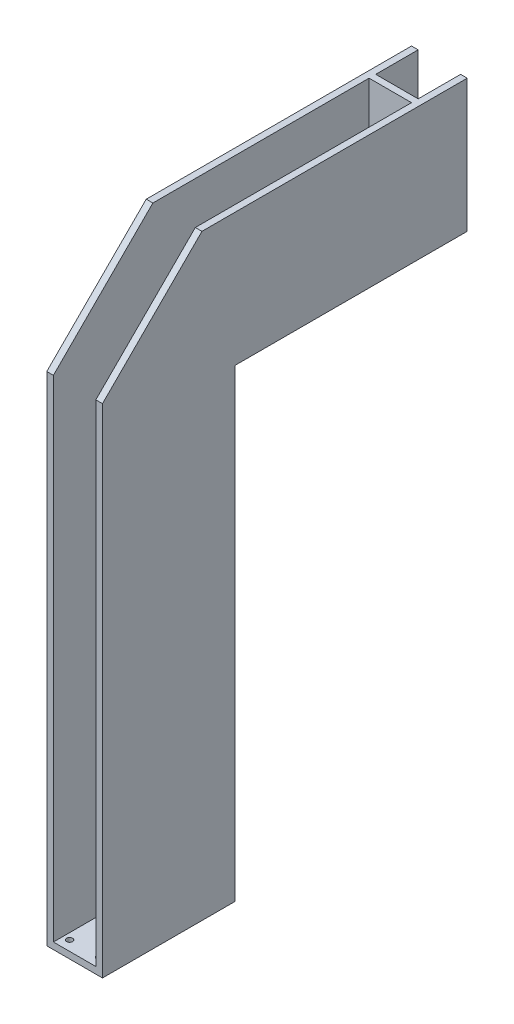
ISO-10303-21;
HEADER;
FILE_DESCRIPTION(('STEP AP214'),'2;1');
FILE_NAME('part.step','',(''),(''),'','','');
FILE_SCHEMA(('AUTOMOTIVE_DESIGN { 1 0 10303 214 1 1 1 1 }'));
ENDSEC;
DATA;
#1=APPLICATION_CONTEXT('core data for automotive mechanical design processes');
#2=APPLICATION_PROTOCOL_DEFINITION('international standard','automotive_design',2000,#1);
#3=PRODUCT_CONTEXT('',#1,'mechanical');
#4=PRODUCT('Part','Part','',(#3));
#5=PRODUCT_RELATED_PRODUCT_CATEGORY('part','',(#4));
#6=PRODUCT_DEFINITION_FORMATION('','',#4);
#7=PRODUCT_DEFINITION_CONTEXT('part definition',#1,'design');
#8=PRODUCT_DEFINITION('design','',#6,#7);
#9=PRODUCT_DEFINITION_SHAPE('','',#8);
#10=(LENGTH_UNIT() NAMED_UNIT(*) SI_UNIT(.MILLI.,.METRE.));
#11=(NAMED_UNIT(*) PLANE_ANGLE_UNIT() SI_UNIT($,.RADIAN.));
#12=(NAMED_UNIT(*) SI_UNIT($,.STERADIAN.) SOLID_ANGLE_UNIT());
#13=UNCERTAINTY_MEASURE_WITH_UNIT(LENGTH_MEASURE(1.E-05),#10,'distance_accuracy_value','');
#14=(GEOMETRIC_REPRESENTATION_CONTEXT(3) GLOBAL_UNCERTAINTY_ASSIGNED_CONTEXT((#13)) GLOBAL_UNIT_ASSIGNED_CONTEXT((#10,
#11,#12)) REPRESENTATION_CONTEXT('',''));
#15=CARTESIAN_POINT('',(0.,0.,0.));
#16=DIRECTION('',(0.,0.,1.));
#17=DIRECTION('',(1.,0.,0.));
#18=AXIS2_PLACEMENT_3D('',#15,#16,#17);
#19=CARTESIAN_POINT('',(0.,-553.711116016285,-550.));
#20=DIRECTION('',(1.,0.,0.));
#21=DIRECTION('',(0.,0.,-1.));
#22=AXIS2_PLACEMENT_3D('',#19,#20,#21);
#23=PLANE('',#22);
#24=DIRECTION('',(0.,-1.,0.));
#25=VECTOR('',#24,1.);
#26=CARTESIAN_POINT('',(0.,710.,-486.));
#27=LINE('',#26,#25);
#28=CARTESIAN_POINT('',(0.,900.,-486.));
#29=VERTEX_POINT('',#28);
#30=CARTESIAN_POINT('',(0.,710.,-486.));
#31=VERTEX_POINT('',#30);
#32=EDGE_CURVE('E52',#29,#31,#27,.T.);
#33=ORIENTED_EDGE('',*,*,#32,.F.);
#34=DIRECTION('',(0.,0.,-1.));
#35=VECTOR('',#34,1.);
#36=CARTESIAN_POINT('',(0.,900.,-550.));
#37=LINE('',#36,#35);
#38=CARTESIAN_POINT('',(0.,900.,-550.));
#39=VERTEX_POINT('',#38);
#40=EDGE_CURVE('E211',#29,#39,#37,.T.);
#41=ORIENTED_EDGE('',*,*,#40,.T.);
#42=DIRECTION('',(0.,1.,0.));
#43=VECTOR('',#42,1.);
#44=CARTESIAN_POINT('',(0.,-553.711116016285,-550.));
#45=LINE('',#44,#43);
#46=CARTESIAN_POINT('',(0.,710.,-550.));
#47=VERTEX_POINT('',#46);
#48=EDGE_CURVE('E225',#47,#39,#45,.T.);
#49=ORIENTED_EDGE('',*,*,#48,.F.);
#50=DIRECTION('',(0.,0.,1.));
#51=VECTOR('',#50,1.);
#52=CARTESIAN_POINT('',(0.,710.,-550.));
#53=LINE('',#52,#51);
#54=EDGE_CURVE('E188',#47,#31,#53,.T.);
#55=ORIENTED_EDGE('',*,*,#54,.T.);
#56=EDGE_LOOP('',(#33,#41,#49,#55));
#57=FACE_BOUND('',#56,.T.);
#58=ADVANCED_FACE('F37',(#57),#23,.F.);
#59=CARTESIAN_POINT('',(-64.,-553.711116016285,-550.));
#60=DIRECTION('',(-1.,0.,0.));
#61=DIRECTION('',(0.,0.,1.));
#62=AXIS2_PLACEMENT_3D('',#59,#60,#61);
#63=PLANE('',#62);
#64=DIRECTION('',(0.,1.,0.));
#65=VECTOR('',#64,1.);
#66=CARTESIAN_POINT('',(-64.,710.,-486.));
#67=LINE('',#66,#65);
#68=CARTESIAN_POINT('',(-64.,710.,-486.));
#69=VERTEX_POINT('',#68);
#70=CARTESIAN_POINT('',(-64.,900.,-486.));
#71=VERTEX_POINT('',#70);
#72=EDGE_CURVE('E344',#69,#71,#67,.T.);
#73=ORIENTED_EDGE('',*,*,#72,.F.);
#74=DIRECTION('',(0.,0.,-1.));
#75=VECTOR('',#74,1.);
#76=CARTESIAN_POINT('',(-64.,710.,-550.));
#77=LINE('',#76,#75);
#78=CARTESIAN_POINT('',(-64.,710.,-550.));
#79=VERTEX_POINT('',#78);
#80=EDGE_CURVE('E202',#69,#79,#77,.T.);
#81=ORIENTED_EDGE('',*,*,#80,.T.);
#82=DIRECTION('',(0.,1.,0.));
#83=VECTOR('',#82,1.);
#84=CARTESIAN_POINT('',(-64.,-553.711116016285,-550.));
#85=LINE('',#84,#83);
#86=CARTESIAN_POINT('',(-64.,900.,-550.));
#87=VERTEX_POINT('',#86);
#88=EDGE_CURVE('E221',#79,#87,#85,.T.);
#89=ORIENTED_EDGE('',*,*,#88,.T.);
#90=DIRECTION('',(0.,0.,1.));
#91=VECTOR('',#90,1.);
#92=CARTESIAN_POINT('',(-64.,900.,-550.));
#93=LINE('',#92,#91);
#94=EDGE_CURVE('E212',#87,#71,#93,.T.);
#95=ORIENTED_EDGE('',*,*,#94,.T.);
#96=EDGE_LOOP('',(#73,#81,#89,#95));
#97=FACE_BOUND('',#96,.T.);
#98=ADVANCED_FACE('F356',(#97),#63,.F.);
#99=CARTESIAN_POINT('',(0.,710.,0.));
#100=DIRECTION('',(0.,1.,0.));
#101=DIRECTION('',(0.,0.,1.));
#102=AXIS2_PLACEMENT_3D('',#99,#100,#101);
#103=PLANE('',#102);
#104=CARTESIAN_POINT('',(-8.49999999999964,710.,-540.999999999998));
#105=DIRECTION('',(0.,1.,0.));
#106=DIRECTION('',(0.,0.,1.));
#107=AXIS2_PLACEMENT_3D('',#104,#105,#106);
#108=CIRCLE('',#107,4.5);
#109=CARTESIAN_POINT('',(-8.49999999999964,710.,-536.499999999998));
#110=VERTEX_POINT('',#109);
#111=EDGE_CURVE('E668',#110,#110,#108,.T.);
#112=ORIENTED_EDGE('',*,*,#111,.F.);
#113=EDGE_LOOP('',(#112));
#114=FACE_BOUND('',#113,.T.);
#115=CARTESIAN_POINT('',(-54.9999999999996,710.,-540.999999999998));
#116=DIRECTION('',(0.,1.,0.));
#117=DIRECTION('',(0.,0.,1.));
#118=AXIS2_PLACEMENT_3D('',#115,#116,#117);
#119=CIRCLE('',#118,4.5);
#120=CARTESIAN_POINT('',(-54.9999999999996,710.,-536.499999999998));
#121=VERTEX_POINT('',#120);
#122=EDGE_CURVE('E662',#121,#121,#119,.T.);
#123=ORIENTED_EDGE('',*,*,#122,.F.);
#124=EDGE_LOOP('',(#123));
#125=FACE_BOUND('',#124,.T.);
#126=CARTESIAN_POINT('',(-54.9999999999996,710.,-494.499999999998));
#127=DIRECTION('',(0.,1.,0.));
#128=DIRECTION('',(0.,0.,1.));
#129=AXIS2_PLACEMENT_3D('',#126,#127,#128);
#130=CIRCLE('',#129,4.5);
#131=CARTESIAN_POINT('',(-54.9999999999996,710.,-489.999999999998));
#132=VERTEX_POINT('',#131);
#133=EDGE_CURVE('E656',#132,#132,#130,.T.);
#134=ORIENTED_EDGE('',*,*,#133,.F.);
#135=EDGE_LOOP('',(#134));
#136=FACE_BOUND('',#135,.T.);
#137=CARTESIAN_POINT('',(-8.49999999999964,710.,-494.499999999998));
#138=DIRECTION('',(0.,1.,0.));
#139=DIRECTION('',(0.,0.,1.));
#140=AXIS2_PLACEMENT_3D('',#137,#138,#139);
#141=CIRCLE('',#140,4.5);
#142=CARTESIAN_POINT('',(-8.49999999999964,710.,-489.999999999998));
#143=VERTEX_POINT('',#142);
#144=EDGE_CURVE('E342',#143,#143,#141,.T.);
#145=ORIENTED_EDGE('',*,*,#144,.F.);
#146=EDGE_LOOP('',(#145));
#147=FACE_BOUND('',#146,.T.);
#148=ORIENTED_EDGE('',*,*,#80,.F.);
#149=DIRECTION('',(-1.,0.,0.));
#150=VECTOR('',#149,1.);
#151=CARTESIAN_POINT('',(0.,710.,-486.));
#152=LINE('',#151,#150);
#153=EDGE_CURVE('E341',#31,#69,#152,.T.);
#154=ORIENTED_EDGE('',*,*,#153,.F.);
#155=ORIENTED_EDGE('',*,*,#54,.F.);
#156=DIRECTION('',(1.,0.,0.));
#157=VECTOR('',#156,1.);
#158=CARTESIAN_POINT('',(-64.,710.,-550.));
#159=LINE('',#158,#157);
#160=EDGE_CURVE('E189',#79,#47,#159,.T.);
#161=ORIENTED_EDGE('',*,*,#160,.F.);
#162=EDGE_LOOP('',(#148,#154,#155,#161));
#163=FACE_BOUND('',#162,.T.);
#164=ADVANCED_FACE('F359',(#114,#125,#136,#147,#163),#103,.T.);
#165=CARTESIAN_POINT('',(-74.,750.,0.));
#166=DIRECTION('',(0.,0.707106781186546,0.707106781186549));
#167=DIRECTION('',(0.,-0.707106781186549,0.707106781186546));
#168=AXIS2_PLACEMENT_3D('',#165,#166,#167);
#169=PLANE('',#168);
#170=DIRECTION('',(0.,0.707106781186549,-0.707106781186546));
#171=VECTOR('',#170,1.);
#172=CARTESIAN_POINT('',(0.,750.,0.));
#173=LINE('',#172,#171);
#174=CARTESIAN_POINT('',(0.,750.,0.));
#175=VERTEX_POINT('',#174);
#176=CARTESIAN_POINT('',(0.,900.,-149.999999999999));
#177=VERTEX_POINT('',#176);
#178=EDGE_CURVE('E234',#175,#177,#173,.T.);
#179=ORIENTED_EDGE('',*,*,#178,.F.);
#180=DIRECTION('',(1.,0.,0.));
#181=VECTOR('',#180,1.);
#182=CARTESIAN_POINT('',(-74.,750.,0.));
#183=LINE('',#182,#181);
#184=CARTESIAN_POINT('',(10.,750.,0.));
#185=VERTEX_POINT('',#184);
#186=EDGE_CURVE('E285',#175,#185,#183,.T.);
#187=ORIENTED_EDGE('',*,*,#186,.T.);
#188=DIRECTION('',(0.,-0.707106781186549,0.707106781186546));
#189=VECTOR('',#188,1.);
#190=CARTESIAN_POINT('',(10.,750.,0.));
#191=LINE('',#190,#189);
#192=CARTESIAN_POINT('',(10.,900.,-149.999999999999));
#193=VERTEX_POINT('',#192);
#194=EDGE_CURVE('E251',#193,#185,#191,.T.);
#195=ORIENTED_EDGE('',*,*,#194,.F.);
#196=DIRECTION('',(1.,0.,0.));
#197=VECTOR('',#196,1.);
#198=CARTESIAN_POINT('',(-74.,900.,-149.999999999999));
#199=LINE('',#198,#197);
#200=EDGE_CURVE('E289',#177,#193,#199,.T.);
#201=ORIENTED_EDGE('',*,*,#200,.F.);
#202=EDGE_LOOP('',(#179,#187,#195,#201));
#203=FACE_BOUND('',#202,.T.);
#204=ADVANCED_FACE('F322',(#203),#169,.T.);
#205=CARTESIAN_POINT('',(-74.,0.,-200.));
#206=DIRECTION('',(0.,-1.,0.));
#207=DIRECTION('',(0.,0.,-1.));
#208=AXIS2_PLACEMENT_3D('',#205,#206,#207);
#209=PLANE('',#208);
#210=CARTESIAN_POINT('',(-9.49999999999995,0.,-185.));
#211=DIRECTION('',(0.,-1.,0.));
#212=DIRECTION('',(0.,0.,-1.));
#213=AXIS2_PLACEMENT_3D('',#210,#211,#212);
#214=CIRCLE('',#213,4.5);
#215=CARTESIAN_POINT('',(-9.49999999999995,0.,-189.5));
#216=VERTEX_POINT('',#215);
#217=EDGE_CURVE('E631',#216,#216,#214,.F.);
#218=ORIENTED_EDGE('',*,*,#217,.T.);
#219=EDGE_LOOP('',(#218));
#220=FACE_BOUND('',#219,.T.);
#221=CARTESIAN_POINT('',(-9.49999999999997,0.,-35.));
#222=DIRECTION('',(0.,-1.,0.));
#223=DIRECTION('',(0.,0.,-1.));
#224=AXIS2_PLACEMENT_3D('',#221,#222,#223);
#225=CIRCLE('',#224,5.);
#226=CARTESIAN_POINT('',(-9.49999999999997,0.,-40.));
#227=VERTEX_POINT('',#226);
#228=EDGE_CURVE('E634',#227,#227,#225,.F.);
#229=ORIENTED_EDGE('',*,*,#228,.T.);
#230=EDGE_LOOP('',(#229));
#231=FACE_BOUND('',#230,.T.);
#232=CARTESIAN_POINT('',(-9.49999999999995,0.,-15.));
#233=DIRECTION('',(0.,-1.,0.));
#234=DIRECTION('',(0.,0.,-1.));
#235=AXIS2_PLACEMENT_3D('',#232,#233,#234);
#236=CIRCLE('',#235,4.5);
#237=CARTESIAN_POINT('',(-9.49999999999995,0.,-19.5));
#238=VERTEX_POINT('',#237);
#239=EDGE_CURVE('E736',#238,#238,#236,.F.);
#240=ORIENTED_EDGE('',*,*,#239,.T.);
#241=EDGE_LOOP('',(#240));
#242=FACE_BOUND('',#241,.T.);
#243=CARTESIAN_POINT('',(-54.5,0.,-15.));
#244=DIRECTION('',(0.,-1.,0.));
#245=DIRECTION('',(0.,0.,-1.));
#246=AXIS2_PLACEMENT_3D('',#243,#244,#245);
#247=CIRCLE('',#246,4.5);
#248=CARTESIAN_POINT('',(-54.5,0.,-19.5));
#249=VERTEX_POINT('',#248);
#250=EDGE_CURVE('E730',#249,#249,#247,.F.);
#251=ORIENTED_EDGE('',*,*,#250,.T.);
#252=EDGE_LOOP('',(#251));
#253=FACE_BOUND('',#252,.T.);
#254=CARTESIAN_POINT('',(-54.4999999999999,0.,-165.));
#255=DIRECTION('',(0.,-1.,0.));
#256=DIRECTION('',(0.,0.,-1.));
#257=AXIS2_PLACEMENT_3D('',#254,#255,#256);
#258=CIRCLE('',#257,5.);
#259=CARTESIAN_POINT('',(-54.4999999999999,0.,-170.));
#260=VERTEX_POINT('',#259);
#261=EDGE_CURVE('E720',#260,#260,#258,.F.);
#262=ORIENTED_EDGE('',*,*,#261,.T.);
#263=EDGE_LOOP('',(#262));
#264=FACE_BOUND('',#263,.T.);
#265=CARTESIAN_POINT('',(-54.4999999999999,0.,-185.));
#266=DIRECTION('',(0.,-1.,0.));
#267=DIRECTION('',(0.,0.,-1.));
#268=AXIS2_PLACEMENT_3D('',#265,#266,#267);
#269=CIRCLE('',#268,4.5);
#270=CARTESIAN_POINT('',(-54.4999999999999,0.,-189.5));
#271=VERTEX_POINT('',#270);
#272=EDGE_CURVE('E646',#271,#271,#269,.F.);
#273=ORIENTED_EDGE('',*,*,#272,.T.);
#274=EDGE_LOOP('',(#273));
#275=FACE_BOUND('',#274,.T.);
#276=DIRECTION('',(1.,0.,0.));
#277=VECTOR('',#276,1.);
#278=CARTESIAN_POINT('',(-74.,0.,-200.));
#279=LINE('',#278,#277);
#280=CARTESIAN_POINT('',(-74.,0.,-200.));
#281=VERTEX_POINT('',#280);
#282=CARTESIAN_POINT('',(10.,0.,-200.));
#283=VERTEX_POINT('',#282);
#284=EDGE_CURVE('E278',#281,#283,#279,.T.);
#285=ORIENTED_EDGE('',*,*,#284,.T.);
#286=DIRECTION('',(0.,0.,-1.));
#287=VECTOR('',#286,1.);
#288=CARTESIAN_POINT('',(10.,0.,-200.));
#289=LINE('',#288,#287);
#290=CARTESIAN_POINT('',(10.,0.,0.));
#291=VERTEX_POINT('',#290);
#292=EDGE_CURVE('E236',#291,#283,#289,.T.);
#293=ORIENTED_EDGE('',*,*,#292,.F.);
#294=DIRECTION('',(1.,0.,0.));
#295=VECTOR('',#294,1.);
#296=CARTESIAN_POINT('',(-74.,0.,0.));
#297=LINE('',#296,#295);
#298=CARTESIAN_POINT('',(-74.,0.,0.));
#299=VERTEX_POINT('',#298);
#300=EDGE_CURVE('E279',#299,#291,#297,.T.);
#301=ORIENTED_EDGE('',*,*,#300,.F.);
#302=DIRECTION('',(0.,0.,-1.));
#303=VECTOR('',#302,1.);
#304=CARTESIAN_POINT('',(-74.,0.,-200.));
#305=LINE('',#304,#303);
#306=EDGE_CURVE('E257',#299,#281,#305,.T.);
#307=ORIENTED_EDGE('',*,*,#306,.T.);
#308=EDGE_LOOP('',(#285,#293,#301,#307));
#309=FACE_BOUND('',#308,.T.);
#310=ADVANCED_FACE('F39',(#220,#231,#242,#253,#264,#275,#309),#209,.T.);
#311=CARTESIAN_POINT('',(-74.,0.,0.));
#312=DIRECTION('',(0.,0.,1.));
#313=DIRECTION('',(1.,0.,0.));
#314=AXIS2_PLACEMENT_3D('',#311,#312,#313);
#315=PLANE('',#314);
#316=DIRECTION('',(0.,1.,0.));
#317=VECTOR('',#316,1.);
#318=CARTESIAN_POINT('',(0.,-553.711116016285,0.));
#319=LINE('',#318,#317);
#320=CARTESIAN_POINT('',(0.,10.,0.));
#321=VERTEX_POINT('',#320);
#322=EDGE_CURVE('E217',#321,#175,#319,.T.);
#323=ORIENTED_EDGE('',*,*,#322,.F.);
#324=DIRECTION('',(1.,0.,0.));
#325=VECTOR('',#324,1.);
#326=CARTESIAN_POINT('',(-64.,10.,0.));
#327=LINE('',#326,#325);
#328=CARTESIAN_POINT('',(-64.,10.,0.));
#329=VERTEX_POINT('',#328);
#330=EDGE_CURVE('E210',#329,#321,#327,.T.);
#331=ORIENTED_EDGE('',*,*,#330,.F.);
#332=DIRECTION('',(0.,1.,0.));
#333=VECTOR('',#332,1.);
#334=CARTESIAN_POINT('',(-64.,-553.711116016285,0.));
#335=LINE('',#334,#333);
#336=CARTESIAN_POINT('',(-64.,750.,0.));
#337=VERTEX_POINT('',#336);
#338=EDGE_CURVE('E220',#329,#337,#335,.T.);
#339=ORIENTED_EDGE('',*,*,#338,.T.);
#340=CARTESIAN_POINT('',(-74.,750.,0.));
#341=VERTEX_POINT('',#340);
#342=EDGE_CURVE('E282',#341,#337,#183,.T.);
#343=ORIENTED_EDGE('',*,*,#342,.F.);
#344=DIRECTION('',(0.,-1.,0.));
#345=VECTOR('',#344,1.);
#346=CARTESIAN_POINT('',(-74.,0.,0.));
#347=LINE('',#346,#345);
#348=EDGE_CURVE('E275',#341,#299,#347,.T.);
#349=ORIENTED_EDGE('',*,*,#348,.T.);
#350=ORIENTED_EDGE('',*,*,#300,.T.);
#351=DIRECTION('',(0.,-1.,0.));
#352=VECTOR('',#351,1.);
#353=CARTESIAN_POINT('',(10.,0.,0.));
#354=LINE('',#353,#352);
#355=EDGE_CURVE('E254',#185,#291,#354,.T.);
#356=ORIENTED_EDGE('',*,*,#355,.F.);
#357=ORIENTED_EDGE('',*,*,#186,.F.);
#358=EDGE_LOOP('',(#323,#331,#339,#343,#349,#350,#356,#357));
#359=FACE_BOUND('',#358,.T.);
#360=ADVANCED_FACE('F316',(#359),#315,.T.);
#361=DIRECTION('',(0.,-0.707106781186549,0.707106781186546));
#362=VECTOR('',#361,1.);
#363=CARTESIAN_POINT('',(-64.,750.,0.));
#364=LINE('',#363,#362);
#365=CARTESIAN_POINT('',(-64.,900.,-149.999999999999));
#366=VERTEX_POINT('',#365);
#367=EDGE_CURVE('E232',#366,#337,#364,.T.);
#368=ORIENTED_EDGE('',*,*,#367,.F.);
#369=CARTESIAN_POINT('',(-74.,900.,-149.999999999999));
#370=VERTEX_POINT('',#369);
#371=EDGE_CURVE('E286',#370,#366,#199,.T.);
#372=ORIENTED_EDGE('',*,*,#371,.F.);
#373=DIRECTION('',(0.,-0.707106781186549,0.707106781186546));
#374=VECTOR('',#373,1.);
#375=CARTESIAN_POINT('',(-74.,750.,0.));
#376=LINE('',#375,#374);
#377=EDGE_CURVE('E272',#370,#341,#376,.T.);
#378=ORIENTED_EDGE('',*,*,#377,.T.);
#379=ORIENTED_EDGE('',*,*,#342,.T.);
#380=EDGE_LOOP('',(#368,#372,#378,#379));
#381=FACE_BOUND('',#380,.T.);
#382=ADVANCED_FACE('F403',(#381),#169,.T.);
#383=CARTESIAN_POINT('',(-74.,900.,-149.999999999999));
#384=DIRECTION('',(0.,1.,0.));
#385=DIRECTION('',(0.,0.,1.));
#386=AXIS2_PLACEMENT_3D('',#383,#384,#385);
#387=PLANE('',#386);
#388=ORIENTED_EDGE('',*,*,#94,.F.);
#389=DIRECTION('',(1.,0.,0.));
#390=VECTOR('',#389,1.);
#391=CARTESIAN_POINT('',(-74.,900.,-550.));
#392=LINE('',#391,#390);
#393=CARTESIAN_POINT('',(-74.,900.,-550.));
#394=VERTEX_POINT('',#393);
#395=EDGE_CURVE('E290',#394,#87,#392,.T.);
#396=ORIENTED_EDGE('',*,*,#395,.F.);
#397=DIRECTION('',(0.,0.,1.));
#398=VECTOR('',#397,1.);
#399=CARTESIAN_POINT('',(-74.,900.,-149.999999999999));
#400=LINE('',#399,#398);
#401=EDGE_CURVE('E269',#394,#370,#400,.T.);
#402=ORIENTED_EDGE('',*,*,#401,.T.);
#403=ORIENTED_EDGE('',*,*,#371,.T.);
#404=CARTESIAN_POINT('',(-64.,900.,-476.));
#405=VERTEX_POINT('',#404);
#406=EDGE_CURVE('E207',#405,#366,#93,.T.);
#407=ORIENTED_EDGE('',*,*,#406,.F.);
#408=DIRECTION('',(1.,0.,0.));
#409=VECTOR('',#408,1.);
#410=CARTESIAN_POINT('',(0.,900.,-476.));
#411=LINE('',#410,#409);
#412=CARTESIAN_POINT('',(0.,900.,-476.));
#413=VERTEX_POINT('',#412);
#414=EDGE_CURVE('E203',#405,#413,#411,.T.);
#415=ORIENTED_EDGE('',*,*,#414,.T.);
#416=EDGE_CURVE('E181',#177,#413,#37,.T.);
#417=ORIENTED_EDGE('',*,*,#416,.F.);
#418=ORIENTED_EDGE('',*,*,#200,.T.);
#419=DIRECTION('',(0.,0.,1.));
#420=VECTOR('',#419,1.);
#421=CARTESIAN_POINT('',(10.,900.,-149.999999999999));
#422=LINE('',#421,#420);
#423=CARTESIAN_POINT('',(10.,900.,-550.));
#424=VERTEX_POINT('',#423);
#425=EDGE_CURVE('E248',#424,#193,#422,.T.);
#426=ORIENTED_EDGE('',*,*,#425,.F.);
#427=EDGE_CURVE('E293',#39,#424,#392,.T.);
#428=ORIENTED_EDGE('',*,*,#427,.F.);
#429=ORIENTED_EDGE('',*,*,#40,.F.);
#430=DIRECTION('',(1.,0.,0.));
#431=VECTOR('',#430,1.);
#432=CARTESIAN_POINT('',(0.,900.,-486.));
#433=LINE('',#432,#431);
#434=EDGE_CURVE('E182',#71,#29,#433,.T.);
#435=ORIENTED_EDGE('',*,*,#434,.F.);
#436=EDGE_LOOP('',(#388,#396,#402,#403,#407,#415,#417,#418,#426,#428,#429,#435));
#437=FACE_BOUND('',#436,.T.);
#438=ADVANCED_FACE('F327',(#437),#387,.T.);
#439=CARTESIAN_POINT('',(-74.,900.,-550.));
#440=DIRECTION('',(0.,0.,-1.));
#441=DIRECTION('',(-1.,0.,0.));
#442=AXIS2_PLACEMENT_3D('',#439,#440,#441);
#443=PLANE('',#442);
#444=ORIENTED_EDGE('',*,*,#88,.F.);
#445=ORIENTED_EDGE('',*,*,#160,.T.);
#446=ORIENTED_EDGE('',*,*,#48,.T.);
#447=ORIENTED_EDGE('',*,*,#427,.T.);
#448=DIRECTION('',(0.,1.,0.));
#449=VECTOR('',#448,1.);
#450=CARTESIAN_POINT('',(10.,900.,-550.));
#451=LINE('',#450,#449);
#452=CARTESIAN_POINT('',(10.,700.,-550.));
#453=VERTEX_POINT('',#452);
#454=EDGE_CURVE('E245',#453,#424,#451,.T.);
#455=ORIENTED_EDGE('',*,*,#454,.F.);
#456=DIRECTION('',(1.,0.,0.));
#457=VECTOR('',#456,1.);
#458=CARTESIAN_POINT('',(-74.,700.,-550.));
#459=LINE('',#458,#457);
#460=CARTESIAN_POINT('',(-74.,700.,-550.));
#461=VERTEX_POINT('',#460);
#462=EDGE_CURVE('E294',#461,#453,#459,.T.);
#463=ORIENTED_EDGE('',*,*,#462,.F.);
#464=DIRECTION('',(0.,1.,0.));
#465=VECTOR('',#464,1.);
#466=CARTESIAN_POINT('',(-74.,900.,-550.));
#467=LINE('',#466,#465);
#468=EDGE_CURVE('E266',#461,#394,#467,.T.);
#469=ORIENTED_EDGE('',*,*,#468,.T.);
#470=ORIENTED_EDGE('',*,*,#395,.T.);
#471=EDGE_LOOP('',(#444,#445,#446,#447,#455,#463,#469,#470));
#472=FACE_BOUND('',#471,.T.);
#473=ADVANCED_FACE('F335',(#472),#443,.T.);
#474=CARTESIAN_POINT('',(-74.,700.,-550.));
#475=DIRECTION('',(0.,-1.,0.));
#476=DIRECTION('',(0.,0.,-1.));
#477=AXIS2_PLACEMENT_3D('',#474,#475,#476);
#478=PLANE('',#477);
#479=CARTESIAN_POINT('',(-8.49999999999964,700.,-540.999999999998));
#480=DIRECTION('',(0.,-1.,0.));
#481=DIRECTION('',(0.,0.,-1.));
#482=AXIS2_PLACEMENT_3D('',#479,#480,#481);
#483=CIRCLE('',#482,4.5);
#484=CARTESIAN_POINT('',(-8.49999999999964,700.,-545.499999999998));
#485=VERTEX_POINT('',#484);
#486=EDGE_CURVE('E655',#485,#485,#483,.F.);
#487=ORIENTED_EDGE('',*,*,#486,.T.);
#488=EDGE_LOOP('',(#487));
#489=FACE_BOUND('',#488,.T.);
#490=CARTESIAN_POINT('',(-54.9999999999996,700.,-540.999999999998));
#491=DIRECTION('',(0.,-1.,0.));
#492=DIRECTION('',(0.,0.,-1.));
#493=AXIS2_PLACEMENT_3D('',#490,#491,#492);
#494=CIRCLE('',#493,4.5);
#495=CARTESIAN_POINT('',(-54.9999999999996,700.,-545.499999999998));
#496=VERTEX_POINT('',#495);
#497=EDGE_CURVE('E665',#496,#496,#494,.F.);
#498=ORIENTED_EDGE('',*,*,#497,.T.);
#499=EDGE_LOOP('',(#498));
#500=FACE_BOUND('',#499,.T.);
#501=CARTESIAN_POINT('',(-54.9999999999996,700.,-494.499999999998));
#502=DIRECTION('',(0.,-1.,0.));
#503=DIRECTION('',(0.,0.,-1.));
#504=AXIS2_PLACEMENT_3D('',#501,#502,#503);
#505=CIRCLE('',#504,4.5);
#506=CARTESIAN_POINT('',(-54.9999999999996,700.,-498.999999999998));
#507=VERTEX_POINT('',#506);
#508=EDGE_CURVE('E659',#507,#507,#505,.F.);
#509=ORIENTED_EDGE('',*,*,#508,.T.);
#510=EDGE_LOOP('',(#509));
#511=FACE_BOUND('',#510,.T.);
#512=CARTESIAN_POINT('',(-8.49999999999964,700.,-494.499999999998));
#513=DIRECTION('',(0.,-1.,0.));
#514=DIRECTION('',(0.,0.,-1.));
#515=AXIS2_PLACEMENT_3D('',#512,#513,#514);
#516=CIRCLE('',#515,4.5);
#517=CARTESIAN_POINT('',(-8.49999999999964,700.,-498.999999999998));
#518=VERTEX_POINT('',#517);
#519=EDGE_CURVE('E347',#518,#518,#516,.F.);
#520=ORIENTED_EDGE('',*,*,#519,.T.);
#521=EDGE_LOOP('',(#520));
#522=FACE_BOUND('',#521,.T.);
#523=ORIENTED_EDGE('',*,*,#462,.T.);
#524=DIRECTION('',(0.,0.,-1.));
#525=VECTOR('',#524,1.);
#526=CARTESIAN_POINT('',(10.,700.,-550.));
#527=LINE('',#526,#525);
#528=CARTESIAN_POINT('',(10.,700.,-200.));
#529=VERTEX_POINT('',#528);
#530=EDGE_CURVE('E242',#529,#453,#527,.T.);
#531=ORIENTED_EDGE('',*,*,#530,.F.);
#532=DIRECTION('',(1.,0.,0.));
#533=VECTOR('',#532,1.);
#534=CARTESIAN_POINT('',(-74.,700.,-200.));
#535=LINE('',#534,#533);
#536=CARTESIAN_POINT('',(0.,700.,-200.));
#537=VERTEX_POINT('',#536);
#538=EDGE_CURVE('E299',#537,#529,#535,.T.);
#539=ORIENTED_EDGE('',*,*,#538,.F.);
#540=DIRECTION('',(-1.,0.,0.));
#541=VECTOR('',#540,1.);
#542=CARTESIAN_POINT('',(-64.,700.,-200.));
#543=LINE('',#542,#541);
#544=CARTESIAN_POINT('',(-64.,700.,-200.));
#545=VERTEX_POINT('',#544);
#546=EDGE_CURVE('E199',#537,#545,#543,.T.);
#547=ORIENTED_EDGE('',*,*,#546,.T.);
#548=CARTESIAN_POINT('',(-74.,700.,-200.));
#549=VERTEX_POINT('',#548);
#550=EDGE_CURVE('E296',#549,#545,#535,.T.);
#551=ORIENTED_EDGE('',*,*,#550,.F.);
#552=DIRECTION('',(0.,0.,-1.));
#553=VECTOR('',#552,1.);
#554=CARTESIAN_POINT('',(-74.,700.,-550.));
#555=LINE('',#554,#553);
#556=EDGE_CURVE('E263',#549,#461,#555,.T.);
#557=ORIENTED_EDGE('',*,*,#556,.T.);
#558=EDGE_LOOP('',(#523,#531,#539,#547,#551,#557));
#559=FACE_BOUND('',#558,.T.);
#560=ADVANCED_FACE('F411',(#489,#500,#511,#522,#559),#478,.T.);
#561=CARTESIAN_POINT('',(-74.,700.,-200.));
#562=DIRECTION('',(0.,0.,-1.));
#563=DIRECTION('',(0.,1.,0.));
#564=AXIS2_PLACEMENT_3D('',#561,#562,#563);
#565=PLANE('',#564);
#566=DIRECTION('',(0.,-1.,0.));
#567=VECTOR('',#566,1.);
#568=CARTESIAN_POINT('',(0.,700.,-200.));
#569=LINE('',#568,#567);
#570=CARTESIAN_POINT('',(0.,10.,-200.));
#571=VERTEX_POINT('',#570);
#572=EDGE_CURVE('E12',#537,#571,#569,.T.);
#573=ORIENTED_EDGE('',*,*,#572,.F.);
#574=ORIENTED_EDGE('',*,*,#538,.T.);
#575=DIRECTION('',(0.,1.,0.));
#576=VECTOR('',#575,1.);
#577=CARTESIAN_POINT('',(10.,700.,-200.));
#578=LINE('',#577,#576);
#579=EDGE_CURVE('E239',#283,#529,#578,.T.);
#580=ORIENTED_EDGE('',*,*,#579,.F.);
#581=ORIENTED_EDGE('',*,*,#284,.F.);
#582=DIRECTION('',(0.,1.,0.));
#583=VECTOR('',#582,1.);
#584=CARTESIAN_POINT('',(-74.,700.,-200.));
#585=LINE('',#584,#583);
#586=EDGE_CURVE('E260',#281,#549,#585,.T.);
#587=ORIENTED_EDGE('',*,*,#586,.T.);
#588=ORIENTED_EDGE('',*,*,#550,.T.);
#589=DIRECTION('',(0.,1.,0.));
#590=VECTOR('',#589,1.);
#591=CARTESIAN_POINT('',(-64.,700.,-200.));
#592=LINE('',#591,#590);
#593=CARTESIAN_POINT('',(-64.,10.,-200.));
#594=VERTEX_POINT('',#593);
#595=EDGE_CURVE('E281',#594,#545,#592,.T.);
#596=ORIENTED_EDGE('',*,*,#595,.F.);
#597=DIRECTION('',(-1.,0.,0.));
#598=VECTOR('',#597,1.);
#599=CARTESIAN_POINT('',(-74.,10.,-200.));
#600=LINE('',#599,#598);
#601=EDGE_CURVE('E45',#571,#594,#600,.T.);
#602=ORIENTED_EDGE('',*,*,#601,.F.);
#603=EDGE_LOOP('',(#573,#574,#580,#581,#587,#588,#596,#602));
#604=FACE_BOUND('',#603,.T.);
#605=ADVANCED_FACE('F309',(#604),#565,.T.);
#606=CARTESIAN_POINT('',(-74.,0.,0.));
#607=DIRECTION('',(-1.,0.,0.));
#608=DIRECTION('',(0.,0.,1.));
#609=AXIS2_PLACEMENT_3D('',#606,#607,#608);
#610=PLANE('',#609);
#611=ORIENTED_EDGE('',*,*,#306,.F.);
#612=ORIENTED_EDGE('',*,*,#348,.F.);
#613=ORIENTED_EDGE('',*,*,#377,.F.);
#614=ORIENTED_EDGE('',*,*,#401,.F.);
#615=ORIENTED_EDGE('',*,*,#468,.F.);
#616=ORIENTED_EDGE('',*,*,#556,.F.);
#617=ORIENTED_EDGE('',*,*,#586,.F.);
#618=EDGE_LOOP('',(#611,#612,#613,#614,#615,#616,#617));
#619=FACE_BOUND('',#618,.T.);
#620=ADVANCED_FACE('F393',(#619),#610,.T.);
#621=CARTESIAN_POINT('',(10.,0.,0.));
#622=DIRECTION('',(-1.,0.,0.));
#623=DIRECTION('',(0.,0.,1.));
#624=AXIS2_PLACEMENT_3D('',#621,#622,#623);
#625=PLANE('',#624);
#626=ORIENTED_EDGE('',*,*,#292,.T.);
#627=ORIENTED_EDGE('',*,*,#579,.T.);
#628=ORIENTED_EDGE('',*,*,#530,.T.);
#629=ORIENTED_EDGE('',*,*,#454,.T.);
#630=ORIENTED_EDGE('',*,*,#425,.T.);
#631=ORIENTED_EDGE('',*,*,#194,.T.);
#632=ORIENTED_EDGE('',*,*,#355,.T.);
#633=EDGE_LOOP('',(#626,#627,#628,#629,#630,#631,#632));
#634=FACE_BOUND('',#633,.T.);
#635=ADVANCED_FACE('F330',(#634),#625,.F.);
#636=CARTESIAN_POINT('',(-74.,9.99999999999999,-200.));
#637=DIRECTION('',(0.,-1.,0.));
#638=DIRECTION('',(0.,0.,-1.));
#639=AXIS2_PLACEMENT_3D('',#636,#637,#638);
#640=PLANE('',#639);
#641=CARTESIAN_POINT('',(-9.49999999999995,9.99999999999999,-185.));
#642=DIRECTION('',(0.,1.,0.));
#643=DIRECTION('',(0.,0.,1.));
#644=AXIS2_PLACEMENT_3D('',#641,#642,#643);
#645=CIRCLE('',#644,4.5);
#646=CARTESIAN_POINT('',(-9.49999999999995,9.99999999999999,-180.5));
#647=VERTEX_POINT('',#646);
#648=EDGE_CURVE('E633',#647,#647,#645,.T.);
#649=ORIENTED_EDGE('',*,*,#648,.F.);
#650=EDGE_LOOP('',(#649));
#651=FACE_BOUND('',#650,.T.);
#652=CARTESIAN_POINT('',(-9.49999999999997,10.,-35.));
#653=DIRECTION('',(0.,1.,0.));
#654=DIRECTION('',(0.,0.,1.));
#655=AXIS2_PLACEMENT_3D('',#652,#653,#654);
#656=CIRCLE('',#655,5.);
#657=CARTESIAN_POINT('',(-9.49999999999997,10.,-30.));
#658=VERTEX_POINT('',#657);
#659=EDGE_CURVE('E637',#658,#658,#656,.T.);
#660=ORIENTED_EDGE('',*,*,#659,.F.);
#661=EDGE_LOOP('',(#660));
#662=FACE_BOUND('',#661,.T.);
#663=CARTESIAN_POINT('',(-9.49999999999995,10.,-15.));
#664=DIRECTION('',(0.,1.,0.));
#665=DIRECTION('',(0.,0.,1.));
#666=AXIS2_PLACEMENT_3D('',#663,#664,#665);
#667=CIRCLE('',#666,4.5);
#668=CARTESIAN_POINT('',(-9.49999999999995,10.,-10.5));
#669=VERTEX_POINT('',#668);
#670=EDGE_CURVE('E733',#669,#669,#667,.T.);
#671=ORIENTED_EDGE('',*,*,#670,.F.);
#672=EDGE_LOOP('',(#671));
#673=FACE_BOUND('',#672,.T.);
#674=CARTESIAN_POINT('',(-54.5,10.,-15.));
#675=DIRECTION('',(0.,1.,0.));
#676=DIRECTION('',(0.,0.,1.));
#677=AXIS2_PLACEMENT_3D('',#674,#675,#676);
#678=CIRCLE('',#677,4.5);
#679=CARTESIAN_POINT('',(-54.5,10.,-10.5));
#680=VERTEX_POINT('',#679);
#681=EDGE_CURVE('E725',#680,#680,#678,.T.);
#682=ORIENTED_EDGE('',*,*,#681,.F.);
#683=EDGE_LOOP('',(#682));
#684=FACE_BOUND('',#683,.T.);
#685=CARTESIAN_POINT('',(-54.4999999999999,9.99999999999999,-165.));
#686=DIRECTION('',(0.,1.,0.));
#687=DIRECTION('',(0.,0.,1.));
#688=AXIS2_PLACEMENT_3D('',#685,#686,#687);
#689=CIRCLE('',#688,5.);
#690=CARTESIAN_POINT('',(-54.4999999999999,9.99999999999999,-160.));
#691=VERTEX_POINT('',#690);
#692=EDGE_CURVE('E649',#691,#691,#689,.T.);
#693=ORIENTED_EDGE('',*,*,#692,.F.);
#694=EDGE_LOOP('',(#693));
#695=FACE_BOUND('',#694,.T.);
#696=CARTESIAN_POINT('',(-54.4999999999999,9.99999999999999,-185.));
#697=DIRECTION('',(0.,1.,0.));
#698=DIRECTION('',(0.,0.,1.));
#699=AXIS2_PLACEMENT_3D('',#696,#697,#698);
#700=CIRCLE('',#699,4.5);
#701=CARTESIAN_POINT('',(-54.4999999999999,9.99999999999999,-180.5));
#702=VERTEX_POINT('',#701);
#703=EDGE_CURVE('E642',#702,#702,#700,.T.);
#704=ORIENTED_EDGE('',*,*,#703,.F.);
#705=EDGE_LOOP('',(#704));
#706=FACE_BOUND('',#705,.T.);
#707=ORIENTED_EDGE('',*,*,#601,.T.);
#708=DIRECTION('',(0.,0.,1.));
#709=VECTOR('',#708,1.);
#710=CARTESIAN_POINT('',(-64.,10.,-550.));
#711=LINE('',#710,#709);
#712=EDGE_CURVE('E218',#594,#329,#711,.T.);
#713=ORIENTED_EDGE('',*,*,#712,.T.);
#714=ORIENTED_EDGE('',*,*,#330,.T.);
#715=DIRECTION('',(0.,0.,-1.));
#716=VECTOR('',#715,1.);
#717=CARTESIAN_POINT('',(0.,10.,-550.));
#718=LINE('',#717,#716);
#719=EDGE_CURVE('E222',#321,#571,#718,.T.);
#720=ORIENTED_EDGE('',*,*,#719,.T.);
#721=EDGE_LOOP('',(#707,#713,#714,#720));
#722=FACE_BOUND('',#721,.T.);
#723=ADVANCED_FACE('F305',(#651,#662,#673,#684,#695,#706,#722),#640,.F.);
#724=ORIENTED_EDGE('',*,*,#416,.T.);
#725=DIRECTION('',(0.,-1.,0.));
#726=VECTOR('',#725,1.);
#727=CARTESIAN_POINT('',(0.,710.,-476.));
#728=LINE('',#727,#726);
#729=CARTESIAN_POINT('',(0.,710.,-476.));
#730=VERTEX_POINT('',#729);
#731=EDGE_CURVE('E170',#413,#730,#728,.T.);
#732=ORIENTED_EDGE('',*,*,#731,.T.);
#733=CARTESIAN_POINT('',(0.,710.,-200.));
#734=VERTEX_POINT('',#733);
#735=EDGE_CURVE('E60',#730,#734,#53,.T.);
#736=ORIENTED_EDGE('',*,*,#735,.T.);
#737=DIRECTION('',(0.,-1.,0.));
#738=VECTOR('',#737,1.);
#739=CARTESIAN_POINT('',(0.,710.,-200.));
#740=LINE('',#739,#738);
#741=EDGE_CURVE('E198',#734,#537,#740,.T.);
#742=ORIENTED_EDGE('',*,*,#741,.T.);
#743=ORIENTED_EDGE('',*,*,#572,.T.);
#744=ORIENTED_EDGE('',*,*,#719,.F.);
#745=ORIENTED_EDGE('',*,*,#322,.T.);
#746=ORIENTED_EDGE('',*,*,#178,.T.);
#747=EDGE_LOOP('',(#724,#732,#736,#742,#743,#744,#745,#746));
#748=FACE_BOUND('',#747,.T.);
#749=ADVANCED_FACE('F179',(#748),#23,.F.);
#750=CARTESIAN_POINT('',(-64.,710.,-200.));
#751=VERTEX_POINT('',#750);
#752=CARTESIAN_POINT('',(-64.,710.,-476.));
#753=VERTEX_POINT('',#752);
#754=EDGE_CURVE('E193',#751,#753,#77,.T.);
#755=ORIENTED_EDGE('',*,*,#754,.T.);
#756=DIRECTION('',(0.,1.,0.));
#757=VECTOR('',#756,1.);
#758=CARTESIAN_POINT('',(-64.,710.,-476.));
#759=LINE('',#758,#757);
#760=EDGE_CURVE('E173',#753,#405,#759,.T.);
#761=ORIENTED_EDGE('',*,*,#760,.T.);
#762=ORIENTED_EDGE('',*,*,#406,.T.);
#763=ORIENTED_EDGE('',*,*,#367,.T.);
#764=ORIENTED_EDGE('',*,*,#338,.F.);
#765=ORIENTED_EDGE('',*,*,#712,.F.);
#766=ORIENTED_EDGE('',*,*,#595,.T.);
#767=DIRECTION('',(0.,-1.,0.));
#768=VECTOR('',#767,1.);
#769=CARTESIAN_POINT('',(-64.,710.,-200.));
#770=LINE('',#769,#768);
#771=EDGE_CURVE('E204',#751,#545,#770,.T.);
#772=ORIENTED_EDGE('',*,*,#771,.F.);
#773=EDGE_LOOP('',(#755,#761,#762,#763,#764,#765,#766,#772));
#774=FACE_BOUND('',#773,.T.);
#775=ADVANCED_FACE('F311',(#774),#63,.F.);
#776=CARTESIAN_POINT('',(-64.,710.,-200.));
#777=DIRECTION('',(0.,0.,1.));
#778=DIRECTION('',(1.,0.,0.));
#779=AXIS2_PLACEMENT_3D('',#776,#777,#778);
#780=PLANE('',#779);
#781=ORIENTED_EDGE('',*,*,#546,.F.);
#782=ORIENTED_EDGE('',*,*,#741,.F.);
#783=DIRECTION('',(-1.,0.,0.));
#784=VECTOR('',#783,1.);
#785=CARTESIAN_POINT('',(-64.,710.,-200.));
#786=LINE('',#785,#784);
#787=EDGE_CURVE('E187',#734,#751,#786,.T.);
#788=ORIENTED_EDGE('',*,*,#787,.T.);
#789=ORIENTED_EDGE('',*,*,#771,.T.);
#790=EDGE_LOOP('',(#781,#782,#788,#789));
#791=FACE_BOUND('',#790,.T.);
#792=ADVANCED_FACE('F388',(#791),#780,.T.);
#793=DIRECTION('',(-1.,0.,0.));
#794=VECTOR('',#793,1.);
#795=CARTESIAN_POINT('',(0.,710.,-476.));
#796=LINE('',#795,#794);
#797=EDGE_CURVE('E168',#730,#753,#796,.T.);
#798=ORIENTED_EDGE('',*,*,#797,.T.);
#799=ORIENTED_EDGE('',*,*,#754,.F.);
#800=ORIENTED_EDGE('',*,*,#787,.F.);
#801=ORIENTED_EDGE('',*,*,#735,.F.);
#802=EDGE_LOOP('',(#798,#799,#800,#801));
#803=FACE_BOUND('',#802,.T.);
#804=ADVANCED_FACE('F185',(#803),#103,.T.);
#805=CARTESIAN_POINT('',(0.,0.,-476.));
#806=DIRECTION('',(0.,0.,1.));
#807=DIRECTION('',(1.,0.,0.));
#808=AXIS2_PLACEMENT_3D('',#805,#806,#807);
#809=PLANE('',#808);
#810=CARTESIAN_POINT('',(-26.2499999999996,732.5,-476.));
#811=DIRECTION('',(0.,0.,1.));
#812=DIRECTION('',(1.,0.,0.));
#813=AXIS2_PLACEMENT_3D('',#810,#811,#812);
#814=CIRCLE('',#813,8.);
#815=CARTESIAN_POINT('',(-18.2499999999996,732.5,-476.));
#816=VERTEX_POINT('',#815);
#817=EDGE_CURVE('E645',#816,#816,#814,.T.);
#818=ORIENTED_EDGE('',*,*,#817,.F.);
#819=EDGE_LOOP('',(#818));
#820=FACE_BOUND('',#819,.T.);
#821=ORIENTED_EDGE('',*,*,#731,.F.);
#822=ORIENTED_EDGE('',*,*,#414,.F.);
#823=ORIENTED_EDGE('',*,*,#760,.F.);
#824=ORIENTED_EDGE('',*,*,#797,.F.);
#825=EDGE_LOOP('',(#821,#822,#823,#824));
#826=FACE_BOUND('',#825,.T.);
#827=ADVANCED_FACE('F169',(#820,#826),#809,.T.);
#828=CARTESIAN_POINT('',(0.,0.,-486.));
#829=DIRECTION('',(0.,0.,1.));
#830=DIRECTION('',(1.,0.,0.));
#831=AXIS2_PLACEMENT_3D('',#828,#829,#830);
#832=PLANE('',#831);
#833=CARTESIAN_POINT('',(-26.2499999999996,732.5,-486.));
#834=DIRECTION('',(0.,0.,1.));
#835=DIRECTION('',(1.,0.,0.));
#836=AXIS2_PLACEMENT_3D('',#833,#834,#835);
#837=CIRCLE('',#836,8.);
#838=CARTESIAN_POINT('',(-18.2499999999996,732.5,-486.));
#839=VERTEX_POINT('',#838);
#840=EDGE_CURVE('E652',#839,#839,#837,.F.);
#841=ORIENTED_EDGE('',*,*,#840,.F.);
#842=EDGE_LOOP('',(#841));
#843=FACE_BOUND('',#842,.T.);
#844=ORIENTED_EDGE('',*,*,#32,.T.);
#845=ORIENTED_EDGE('',*,*,#153,.T.);
#846=ORIENTED_EDGE('',*,*,#72,.T.);
#847=ORIENTED_EDGE('',*,*,#434,.T.);
#848=EDGE_LOOP('',(#844,#845,#846,#847));
#849=FACE_BOUND('',#848,.T.);
#850=ADVANCED_FACE('F360',(#843,#849),#832,.F.);
#851=CARTESIAN_POINT('',(-8.49999999999964,-0.00100000000002876,-494.499999999998));
#852=DIRECTION('',(0.,1.,0.));
#853=DIRECTION('',(0.,0.,1.));
#854=AXIS2_PLACEMENT_3D('',#851,#852,#853);
#855=CYLINDRICAL_SURFACE('',#854,4.5);
#856=ORIENTED_EDGE('',*,*,#519,.F.);
#857=EDGE_LOOP('',(#856));
#858=FACE_BOUND('',#857,.T.);
#859=ORIENTED_EDGE('',*,*,#144,.T.);
#860=EDGE_LOOP('',(#859));
#861=FACE_BOUND('',#860,.T.);
#862=ADVANCED_FACE('F362',(#858,#861),#855,.F.);
#863=CARTESIAN_POINT('',(-54.9999999999996,-0.00100000000002876,-494.499999999998));
#864=DIRECTION('',(0.,1.,0.));
#865=DIRECTION('',(0.,0.,1.));
#866=AXIS2_PLACEMENT_3D('',#863,#864,#865);
#867=CYLINDRICAL_SURFACE('',#866,4.5);
#868=ORIENTED_EDGE('',*,*,#508,.F.);
#869=EDGE_LOOP('',(#868));
#870=FACE_BOUND('',#869,.T.);
#871=ORIENTED_EDGE('',*,*,#133,.T.);
#872=EDGE_LOOP('',(#871));
#873=FACE_BOUND('',#872,.T.);
#874=ADVANCED_FACE('F369',(#870,#873),#867,.F.);
#875=CARTESIAN_POINT('',(-54.9999999999996,-0.00100000000002876,-540.999999999998));
#876=DIRECTION('',(0.,1.,0.));
#877=DIRECTION('',(0.,0.,1.));
#878=AXIS2_PLACEMENT_3D('',#875,#876,#877);
#879=CYLINDRICAL_SURFACE('',#878,4.5);
#880=ORIENTED_EDGE('',*,*,#497,.F.);
#881=EDGE_LOOP('',(#880));
#882=FACE_BOUND('',#881,.T.);
#883=ORIENTED_EDGE('',*,*,#122,.T.);
#884=EDGE_LOOP('',(#883));
#885=FACE_BOUND('',#884,.T.);
#886=ADVANCED_FACE('F517',(#882,#885),#879,.F.);
#887=CARTESIAN_POINT('',(-8.49999999999964,-0.00100000000002876,-540.999999999998));
#888=DIRECTION('',(0.,1.,0.));
#889=DIRECTION('',(0.,0.,1.));
#890=AXIS2_PLACEMENT_3D('',#887,#888,#889);
#891=CYLINDRICAL_SURFACE('',#890,4.5);
#892=ORIENTED_EDGE('',*,*,#486,.F.);
#893=EDGE_LOOP('',(#892));
#894=FACE_BOUND('',#893,.T.);
#895=ORIENTED_EDGE('',*,*,#111,.T.);
#896=EDGE_LOOP('',(#895));
#897=FACE_BOUND('',#896,.T.);
#898=ADVANCED_FACE('F527',(#894,#897),#891,.F.);
#899=CARTESIAN_POINT('',(-26.2499999999996,732.5,-550.001));
#900=DIRECTION('',(0.,0.,1.));
#901=DIRECTION('',(1.,0.,0.));
#902=AXIS2_PLACEMENT_3D('',#899,#900,#901);
#903=CYLINDRICAL_SURFACE('',#902,8.);
#904=ORIENTED_EDGE('',*,*,#817,.T.);
#905=EDGE_LOOP('',(#904));
#906=FACE_BOUND('',#905,.T.);
#907=ORIENTED_EDGE('',*,*,#840,.T.);
#908=EDGE_LOOP('',(#907));
#909=FACE_BOUND('',#908,.T.);
#910=ADVANCED_FACE('F537',(#906,#909),#903,.F.);
#911=CARTESIAN_POINT('',(-54.4999999999999,-0.00100000000000967,-185.));
#912=DIRECTION('',(0.,1.,0.));
#913=DIRECTION('',(0.,0.,1.));
#914=AXIS2_PLACEMENT_3D('',#911,#912,#913);
#915=CYLINDRICAL_SURFACE('',#914,4.5);
#916=ORIENTED_EDGE('',*,*,#272,.F.);
#917=EDGE_LOOP('',(#916));
#918=FACE_BOUND('',#917,.T.);
#919=ORIENTED_EDGE('',*,*,#703,.T.);
#920=EDGE_LOOP('',(#919));
#921=FACE_BOUND('',#920,.T.);
#922=ADVANCED_FACE('F555',(#918,#921),#915,.F.);
#923=CARTESIAN_POINT('',(-54.4999999999999,-0.00100000000000967,-165.));
#924=DIRECTION('',(0.,1.,0.));
#925=DIRECTION('',(0.,0.,1.));
#926=AXIS2_PLACEMENT_3D('',#923,#924,#925);
#927=CYLINDRICAL_SURFACE('',#926,5.);
#928=ORIENTED_EDGE('',*,*,#261,.F.);
#929=EDGE_LOOP('',(#928));
#930=FACE_BOUND('',#929,.T.);
#931=ORIENTED_EDGE('',*,*,#692,.T.);
#932=EDGE_LOOP('',(#931));
#933=FACE_BOUND('',#932,.T.);
#934=ADVANCED_FACE('F574',(#930,#933),#927,.F.);
#935=CARTESIAN_POINT('',(-54.5,-0.00100000000000447,-15.));
#936=DIRECTION('',(0.,1.,0.));
#937=DIRECTION('',(0.,0.,1.));
#938=AXIS2_PLACEMENT_3D('',#935,#936,#937);
#939=CYLINDRICAL_SURFACE('',#938,4.5);
#940=ORIENTED_EDGE('',*,*,#250,.F.);
#941=EDGE_LOOP('',(#940));
#942=FACE_BOUND('',#941,.T.);
#943=ORIENTED_EDGE('',*,*,#681,.T.);
#944=EDGE_LOOP('',(#943));
#945=FACE_BOUND('',#944,.T.);
#946=ADVANCED_FACE('F584',(#942,#945),#939,.F.);
#947=CARTESIAN_POINT('',(-9.49999999999995,-0.00100000000000447,-15.));
#948=DIRECTION('',(0.,1.,0.));
#949=DIRECTION('',(0.,0.,1.));
#950=AXIS2_PLACEMENT_3D('',#947,#948,#949);
#951=CYLINDRICAL_SURFACE('',#950,4.5);
#952=ORIENTED_EDGE('',*,*,#239,.F.);
#953=EDGE_LOOP('',(#952));
#954=FACE_BOUND('',#953,.T.);
#955=ORIENTED_EDGE('',*,*,#670,.T.);
#956=EDGE_LOOP('',(#955));
#957=FACE_BOUND('',#956,.T.);
#958=ADVANCED_FACE('F594',(#954,#957),#951,.F.);
#959=CARTESIAN_POINT('',(-9.49999999999997,-0.0010000000000062,-35.));
#960=DIRECTION('',(0.,1.,0.));
#961=DIRECTION('',(0.,0.,1.));
#962=AXIS2_PLACEMENT_3D('',#959,#960,#961);
#963=CYLINDRICAL_SURFACE('',#962,5.);
#964=ORIENTED_EDGE('',*,*,#228,.F.);
#965=EDGE_LOOP('',(#964));
#966=FACE_BOUND('',#965,.T.);
#967=ORIENTED_EDGE('',*,*,#659,.T.);
#968=EDGE_LOOP('',(#967));
#969=FACE_BOUND('',#968,.T.);
#970=ADVANCED_FACE('F604',(#966,#969),#963,.F.);
#971=CARTESIAN_POINT('',(-9.49999999999995,-0.00100000000000967,-185.));
#972=DIRECTION('',(0.,1.,0.));
#973=DIRECTION('',(0.,0.,1.));
#974=AXIS2_PLACEMENT_3D('',#971,#972,#973);
#975=CYLINDRICAL_SURFACE('',#974,4.5);
#976=ORIENTED_EDGE('',*,*,#217,.F.);
#977=EDGE_LOOP('',(#976));
#978=FACE_BOUND('',#977,.T.);
#979=ORIENTED_EDGE('',*,*,#648,.T.);
#980=EDGE_LOOP('',(#979));
#981=FACE_BOUND('',#980,.T.);
#982=ADVANCED_FACE('F614',(#978,#981),#975,.F.);
#983=CLOSED_SHELL('',(#58,#98,#164,#204,#310,#360,#382,#438,#473,#560,#605,#620,#635,#723,#749,
#775,#792,#804,#827,#850,#862,#874,#886,#898,#910,#922,#934,#946,#958,#970,#982));
#984=MANIFOLD_SOLID_BREP('B2',#983);
#985=ADVANCED_BREP_SHAPE_REPRESENTATION('',(#18,#984),#14);
#986=SHAPE_DEFINITION_REPRESENTATION(#9,#985);
ENDSEC;
END-ISO-10303-21;
